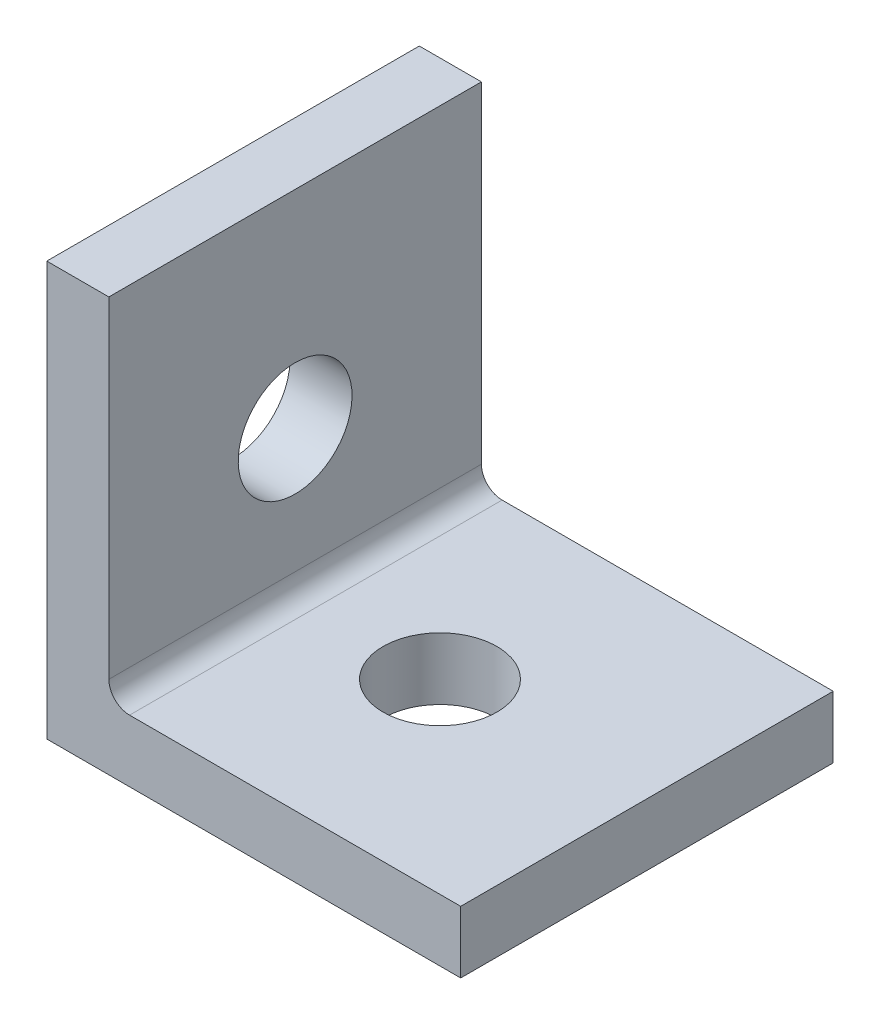
ISO-10303-21;
HEADER;
FILE_DESCRIPTION(('STEP AP214'),'2;1');
FILE_NAME('part.step','',(''),(''),'','','');
FILE_SCHEMA(('AUTOMOTIVE_DESIGN { 1 0 10303 214 1 1 1 1 }'));
ENDSEC;
DATA;
#1=APPLICATION_CONTEXT('core data for automotive mechanical design processes');
#2=APPLICATION_PROTOCOL_DEFINITION('international standard','automotive_design',2000,#1);
#3=PRODUCT_CONTEXT('',#1,'mechanical');
#4=PRODUCT('Part','Part','',(#3));
#5=PRODUCT_RELATED_PRODUCT_CATEGORY('part','',(#4));
#6=PRODUCT_DEFINITION_FORMATION('','',#4);
#7=PRODUCT_DEFINITION_CONTEXT('part definition',#1,'design');
#8=PRODUCT_DEFINITION('design','',#6,#7);
#9=PRODUCT_DEFINITION_SHAPE('','',#8);
#10=(LENGTH_UNIT() NAMED_UNIT(*) SI_UNIT(.MILLI.,.METRE.));
#11=(NAMED_UNIT(*) PLANE_ANGLE_UNIT() SI_UNIT($,.RADIAN.));
#12=(NAMED_UNIT(*) SI_UNIT($,.STERADIAN.) SOLID_ANGLE_UNIT());
#13=UNCERTAINTY_MEASURE_WITH_UNIT(LENGTH_MEASURE(1.E-05),#10,'distance_accuracy_value','');
#14=(GEOMETRIC_REPRESENTATION_CONTEXT(3) GLOBAL_UNCERTAINTY_ASSIGNED_CONTEXT((#13)) GLOBAL_UNIT_ASSIGNED_CONTEXT((#10,
#11,#12)) REPRESENTATION_CONTEXT('',''));
#15=CARTESIAN_POINT('',(0.,0.,0.));
#16=DIRECTION('',(0.,0.,1.));
#17=DIRECTION('',(1.,0.,0.));
#18=AXIS2_PLACEMENT_3D('',#15,#16,#17);
#19=CARTESIAN_POINT('',(20.,0.,9.));
#20=DIRECTION('',(0.,1.,0.));
#21=DIRECTION('',(-1.,0.,0.));
#22=AXIS2_PLACEMENT_3D('',#19,#20,#21);
#23=PLANE('',#22);
#24=CARTESIAN_POINT('',(10.,0.,0.));
#25=DIRECTION('',(0.,1.,0.));
#26=DIRECTION('',(0.,0.,1.));
#27=AXIS2_PLACEMENT_3D('',#24,#25,#26);
#28=CIRCLE('',#27,2.75);
#29=CARTESIAN_POINT('',(10.,0.,2.75));
#30=VERTEX_POINT('',#29);
#31=EDGE_CURVE('E126',#30,#30,#28,.T.);
#32=ORIENTED_EDGE('',*,*,#31,.T.);
#33=EDGE_LOOP('',(#32));
#34=FACE_BOUND('',#33,.T.);
#35=DIRECTION('',(1.,0.,0.));
#36=VECTOR('',#35,1.);
#37=CARTESIAN_POINT('',(20.,0.,-9.));
#38=LINE('',#37,#36);
#39=CARTESIAN_POINT('',(0.,0.,-9.));
#40=VERTEX_POINT('',#39);
#41=CARTESIAN_POINT('',(20.,0.,-9.));
#42=VERTEX_POINT('',#41);
#43=EDGE_CURVE('E122',#40,#42,#38,.T.);
#44=ORIENTED_EDGE('',*,*,#43,.T.);
#45=DIRECTION('',(0.,0.,-1.));
#46=VECTOR('',#45,1.);
#47=CARTESIAN_POINT('',(20.,0.,9.));
#48=LINE('',#47,#46);
#49=CARTESIAN_POINT('',(20.,0.,9.));
#50=VERTEX_POINT('',#49);
#51=EDGE_CURVE('E11',#50,#42,#48,.T.);
#52=ORIENTED_EDGE('',*,*,#51,.F.);
#53=DIRECTION('',(1.,0.,0.));
#54=VECTOR('',#53,1.);
#55=CARTESIAN_POINT('',(20.,0.,9.));
#56=LINE('',#55,#54);
#57=CARTESIAN_POINT('',(0.,0.,9.));
#58=VERTEX_POINT('',#57);
#59=EDGE_CURVE('E135',#58,#50,#56,.T.);
#60=ORIENTED_EDGE('',*,*,#59,.F.);
#61=DIRECTION('',(0.,0.,-1.));
#62=VECTOR('',#61,1.);
#63=CARTESIAN_POINT('',(0.,0.,9.));
#64=LINE('',#63,#62);
#65=EDGE_CURVE('E118',#58,#40,#64,.T.);
#66=ORIENTED_EDGE('',*,*,#65,.T.);
#67=EDGE_LOOP('',(#44,#52,#60,#66));
#68=FACE_BOUND('',#67,.T.);
#69=ADVANCED_FACE('F32',(#34,#68),#23,.F.);
#70=CARTESIAN_POINT('',(20.,3.,9.));
#71=DIRECTION('',(-1.,0.,0.));
#72=DIRECTION('',(0.,0.,1.));
#73=AXIS2_PLACEMENT_3D('',#70,#71,#72);
#74=PLANE('',#73);
#75=DIRECTION('',(0.,1.,0.));
#76=VECTOR('',#75,1.);
#77=CARTESIAN_POINT('',(20.,3.,-9.));
#78=LINE('',#77,#76);
#79=CARTESIAN_POINT('',(20.,3.,-9.));
#80=VERTEX_POINT('',#79);
#81=EDGE_CURVE('E125',#42,#80,#78,.T.);
#82=ORIENTED_EDGE('',*,*,#81,.T.);
#83=DIRECTION('',(0.,0.,-1.));
#84=VECTOR('',#83,1.);
#85=CARTESIAN_POINT('',(20.,3.,9.));
#86=LINE('',#85,#84);
#87=CARTESIAN_POINT('',(20.,3.,9.));
#88=VERTEX_POINT('',#87);
#89=EDGE_CURVE('E40',#88,#80,#86,.T.);
#90=ORIENTED_EDGE('',*,*,#89,.F.);
#91=DIRECTION('',(0.,1.,0.));
#92=VECTOR('',#91,1.);
#93=CARTESIAN_POINT('',(20.,3.,9.));
#94=LINE('',#93,#92);
#95=EDGE_CURVE('E88',#50,#88,#94,.T.);
#96=ORIENTED_EDGE('',*,*,#95,.F.);
#97=ORIENTED_EDGE('',*,*,#51,.T.);
#98=EDGE_LOOP('',(#82,#90,#96,#97));
#99=FACE_BOUND('',#98,.T.);
#100=ADVANCED_FACE('F188',(#99),#74,.F.);
#101=CARTESIAN_POINT('',(4.,3.,9.));
#102=DIRECTION('',(0.,-1.,0.));
#103=DIRECTION('',(0.,0.,-1.));
#104=AXIS2_PLACEMENT_3D('',#101,#102,#103);
#105=PLANE('',#104);
#106=CARTESIAN_POINT('',(10.,3.,0.));
#107=DIRECTION('',(0.,1.,0.));
#108=DIRECTION('',(0.,0.,1.));
#109=AXIS2_PLACEMENT_3D('',#106,#107,#108);
#110=CIRCLE('',#109,2.75);
#111=CARTESIAN_POINT('',(10.,3.,2.75));
#112=VERTEX_POINT('',#111);
#113=EDGE_CURVE('E158',#112,#112,#110,.T.);
#114=ORIENTED_EDGE('',*,*,#113,.F.);
#115=EDGE_LOOP('',(#114));
#116=FACE_BOUND('',#115,.T.);
#117=DIRECTION('',(-1.,0.,0.));
#118=VECTOR('',#117,1.);
#119=CARTESIAN_POINT('',(4.,3.,-9.));
#120=LINE('',#119,#118);
#121=CARTESIAN_POINT('',(4.,3.,-9.));
#122=VERTEX_POINT('',#121);
#123=EDGE_CURVE('E128',#80,#122,#120,.T.);
#124=ORIENTED_EDGE('',*,*,#123,.T.);
#125=DIRECTION('',(0.,0.,-1.));
#126=VECTOR('',#125,1.);
#127=CARTESIAN_POINT('',(4.,3.,9.));
#128=LINE('',#127,#126);
#129=CARTESIAN_POINT('',(4.,3.,9.));
#130=VERTEX_POINT('',#129);
#131=EDGE_CURVE('E139',#130,#122,#128,.T.);
#132=ORIENTED_EDGE('',*,*,#131,.F.);
#133=DIRECTION('',(-1.,0.,0.));
#134=VECTOR('',#133,1.);
#135=CARTESIAN_POINT('',(4.,3.,9.));
#136=LINE('',#135,#134);
#137=EDGE_CURVE('E147',#88,#130,#136,.T.);
#138=ORIENTED_EDGE('',*,*,#137,.F.);
#139=ORIENTED_EDGE('',*,*,#89,.T.);
#140=EDGE_LOOP('',(#124,#132,#138,#139));
#141=FACE_BOUND('',#140,.T.);
#142=ADVANCED_FACE('F145',(#116,#141),#105,.F.);
#143=CARTESIAN_POINT('',(4.,4.,9.));
#144=DIRECTION('',(0.,0.,-1.));
#145=DIRECTION('',(-1.,0.,0.));
#146=AXIS2_PLACEMENT_3D('',#143,#144,#145);
#147=CYLINDRICAL_SURFACE('',#146,1.);
#148=CARTESIAN_POINT('',(4.,4.,-9.));
#149=DIRECTION('',(0.,0.,-1.));
#150=DIRECTION('',(-1.,0.,0.));
#151=AXIS2_PLACEMENT_3D('',#148,#149,#150);
#152=CIRCLE('',#151,1.);
#153=CARTESIAN_POINT('',(3.,4.,-9.));
#154=VERTEX_POINT('',#153);
#155=EDGE_CURVE('E130',#122,#154,#152,.T.);
#156=ORIENTED_EDGE('',*,*,#155,.T.);
#157=DIRECTION('',(0.,0.,-1.));
#158=VECTOR('',#157,1.);
#159=CARTESIAN_POINT('',(3.,4.,9.));
#160=LINE('',#159,#158);
#161=CARTESIAN_POINT('',(3.,4.,9.));
#162=VERTEX_POINT('',#161);
#163=EDGE_CURVE('E113',#162,#154,#160,.T.);
#164=ORIENTED_EDGE('',*,*,#163,.F.);
#165=CARTESIAN_POINT('',(4.,4.,9.));
#166=DIRECTION('',(0.,0.,-1.));
#167=DIRECTION('',(-1.,0.,0.));
#168=AXIS2_PLACEMENT_3D('',#165,#166,#167);
#169=CIRCLE('',#168,1.);
#170=EDGE_CURVE('E104',#130,#162,#169,.T.);
#171=ORIENTED_EDGE('',*,*,#170,.F.);
#172=ORIENTED_EDGE('',*,*,#131,.T.);
#173=EDGE_LOOP('',(#156,#164,#171,#172));
#174=FACE_BOUND('',#173,.T.);
#175=ADVANCED_FACE('F153',(#174),#147,.F.);
#176=CARTESIAN_POINT('',(3.,20.,9.));
#177=DIRECTION('',(-1.,0.,0.));
#178=DIRECTION('',(0.,-1.,0.));
#179=AXIS2_PLACEMENT_3D('',#176,#177,#178);
#180=PLANE('',#179);
#181=CARTESIAN_POINT('',(3.,9.99999999999999,0.));
#182=DIRECTION('',(1.,0.,0.));
#183=DIRECTION('',(0.,1.,0.));
#184=AXIS2_PLACEMENT_3D('',#181,#182,#183);
#185=CIRCLE('',#184,2.75);
#186=CARTESIAN_POINT('',(3.,12.75,0.));
#187=VERTEX_POINT('',#186);
#188=EDGE_CURVE('E164',#187,#187,#185,.T.);
#189=ORIENTED_EDGE('',*,*,#188,.F.);
#190=EDGE_LOOP('',(#189));
#191=FACE_BOUND('',#190,.T.);
#192=DIRECTION('',(0.,1.,0.));
#193=VECTOR('',#192,1.);
#194=CARTESIAN_POINT('',(3.,20.,-9.));
#195=LINE('',#194,#193);
#196=CARTESIAN_POINT('',(3.,20.,-9.));
#197=VERTEX_POINT('',#196);
#198=EDGE_CURVE('E112',#154,#197,#195,.T.);
#199=ORIENTED_EDGE('',*,*,#198,.T.);
#200=DIRECTION('',(0.,0.,-1.));
#201=VECTOR('',#200,1.);
#202=CARTESIAN_POINT('',(3.,20.,9.));
#203=LINE('',#202,#201);
#204=CARTESIAN_POINT('',(3.,20.,9.));
#205=VERTEX_POINT('',#204);
#206=EDGE_CURVE('E109',#205,#197,#203,.T.);
#207=ORIENTED_EDGE('',*,*,#206,.F.);
#208=DIRECTION('',(0.,1.,0.));
#209=VECTOR('',#208,1.);
#210=CARTESIAN_POINT('',(3.,20.,9.));
#211=LINE('',#210,#209);
#212=EDGE_CURVE('E98',#162,#205,#211,.T.);
#213=ORIENTED_EDGE('',*,*,#212,.F.);
#214=ORIENTED_EDGE('',*,*,#163,.T.);
#215=EDGE_LOOP('',(#199,#207,#213,#214));
#216=FACE_BOUND('',#215,.T.);
#217=ADVANCED_FACE('F110',(#191,#216),#180,.F.);
#218=CARTESIAN_POINT('',(0.,20.,9.));
#219=DIRECTION('',(0.,-1.,0.));
#220=DIRECTION('',(0.,0.,-1.));
#221=AXIS2_PLACEMENT_3D('',#218,#219,#220);
#222=PLANE('',#221);
#223=DIRECTION('',(-1.,0.,0.));
#224=VECTOR('',#223,1.);
#225=CARTESIAN_POINT('',(0.,20.,-9.));
#226=LINE('',#225,#224);
#227=CARTESIAN_POINT('',(0.,20.,-9.));
#228=VERTEX_POINT('',#227);
#229=EDGE_CURVE('E74',#197,#228,#226,.T.);
#230=ORIENTED_EDGE('',*,*,#229,.T.);
#231=DIRECTION('',(0.,0.,-1.));
#232=VECTOR('',#231,1.);
#233=CARTESIAN_POINT('',(0.,20.,9.));
#234=LINE('',#233,#232);
#235=CARTESIAN_POINT('',(0.,20.,9.));
#236=VERTEX_POINT('',#235);
#237=EDGE_CURVE('E114',#236,#228,#234,.T.);
#238=ORIENTED_EDGE('',*,*,#237,.F.);
#239=DIRECTION('',(-1.,0.,0.));
#240=VECTOR('',#239,1.);
#241=CARTESIAN_POINT('',(0.,20.,9.));
#242=LINE('',#241,#240);
#243=EDGE_CURVE('E102',#205,#236,#242,.T.);
#244=ORIENTED_EDGE('',*,*,#243,.F.);
#245=ORIENTED_EDGE('',*,*,#206,.T.);
#246=EDGE_LOOP('',(#230,#238,#244,#245));
#247=FACE_BOUND('',#246,.T.);
#248=ADVANCED_FACE('F116',(#247),#222,.F.);
#249=CARTESIAN_POINT('',(0.,0.,9.));
#250=DIRECTION('',(1.,0.,0.));
#251=DIRECTION('',(0.,0.,-1.));
#252=AXIS2_PLACEMENT_3D('',#249,#250,#251);
#253=PLANE('',#252);
#254=CARTESIAN_POINT('',(0.,9.99999999999999,0.));
#255=DIRECTION('',(1.,0.,0.));
#256=DIRECTION('',(0.,1.,0.));
#257=AXIS2_PLACEMENT_3D('',#254,#255,#256);
#258=CIRCLE('',#257,2.75);
#259=CARTESIAN_POINT('',(0.,12.75,0.));
#260=VERTEX_POINT('',#259);
#261=EDGE_CURVE('E161',#260,#260,#258,.T.);
#262=ORIENTED_EDGE('',*,*,#261,.T.);
#263=EDGE_LOOP('',(#262));
#264=FACE_BOUND('',#263,.T.);
#265=DIRECTION('',(0.,-1.,0.));
#266=VECTOR('',#265,1.);
#267=CARTESIAN_POINT('',(0.,0.,-9.));
#268=LINE('',#267,#266);
#269=EDGE_CURVE('E80',#228,#40,#268,.T.);
#270=ORIENTED_EDGE('',*,*,#269,.T.);
#271=ORIENTED_EDGE('',*,*,#65,.F.);
#272=DIRECTION('',(0.,-1.,0.));
#273=VECTOR('',#272,1.);
#274=CARTESIAN_POINT('',(0.,0.,9.));
#275=LINE('',#274,#273);
#276=EDGE_CURVE('E48',#236,#58,#275,.T.);
#277=ORIENTED_EDGE('',*,*,#276,.F.);
#278=ORIENTED_EDGE('',*,*,#237,.T.);
#279=EDGE_LOOP('',(#270,#271,#277,#278));
#280=FACE_BOUND('',#279,.T.);
#281=ADVANCED_FACE('F170',(#264,#280),#253,.F.);
#282=CARTESIAN_POINT('',(4.,4.,9.));
#283=DIRECTION('',(0.,0.,-1.));
#284=DIRECTION('',(-1.,0.,0.));
#285=AXIS2_PLACEMENT_3D('',#282,#283,#284);
#286=PLANE('',#285);
#287=ORIENTED_EDGE('',*,*,#59,.T.);
#288=ORIENTED_EDGE('',*,*,#95,.T.);
#289=ORIENTED_EDGE('',*,*,#137,.T.);
#290=ORIENTED_EDGE('',*,*,#170,.T.);
#291=ORIENTED_EDGE('',*,*,#212,.T.);
#292=ORIENTED_EDGE('',*,*,#243,.T.);
#293=ORIENTED_EDGE('',*,*,#276,.T.);
#294=EDGE_LOOP('',(#287,#288,#289,#290,#291,#292,#293));
#295=FACE_BOUND('',#294,.T.);
#296=ADVANCED_FACE('F100',(#295),#286,.F.);
#297=CARTESIAN_POINT('',(4.,4.,-9.));
#298=DIRECTION('',(0.,0.,-1.));
#299=DIRECTION('',(-1.,0.,0.));
#300=AXIS2_PLACEMENT_3D('',#297,#298,#299);
#301=PLANE('',#300);
#302=ORIENTED_EDGE('',*,*,#43,.F.);
#303=ORIENTED_EDGE('',*,*,#269,.F.);
#304=ORIENTED_EDGE('',*,*,#229,.F.);
#305=ORIENTED_EDGE('',*,*,#198,.F.);
#306=ORIENTED_EDGE('',*,*,#155,.F.);
#307=ORIENTED_EDGE('',*,*,#123,.F.);
#308=ORIENTED_EDGE('',*,*,#81,.F.);
#309=EDGE_LOOP('',(#302,#303,#304,#305,#306,#307,#308));
#310=FACE_BOUND('',#309,.T.);
#311=ADVANCED_FACE('F151',(#310),#301,.T.);
#312=CARTESIAN_POINT('',(10.,0.,0.));
#313=DIRECTION('',(0.,1.,0.));
#314=DIRECTION('',(0.,0.,1.));
#315=AXIS2_PLACEMENT_3D('',#312,#313,#314);
#316=CYLINDRICAL_SURFACE('',#315,2.75);
#317=ORIENTED_EDGE('',*,*,#31,.F.);
#318=EDGE_LOOP('',(#317));
#319=FACE_BOUND('',#318,.T.);
#320=ORIENTED_EDGE('',*,*,#113,.T.);
#321=EDGE_LOOP('',(#320));
#322=FACE_BOUND('',#321,.T.);
#323=ADVANCED_FACE('F175',(#319,#322),#316,.F.);
#324=CARTESIAN_POINT('',(0.,9.99999999999999,0.));
#325=DIRECTION('',(1.,0.,0.));
#326=DIRECTION('',(0.,1.,0.));
#327=AXIS2_PLACEMENT_3D('',#324,#325,#326);
#328=CYLINDRICAL_SURFACE('',#327,2.75);
#329=ORIENTED_EDGE('',*,*,#261,.F.);
#330=EDGE_LOOP('',(#329));
#331=FACE_BOUND('',#330,.T.);
#332=ORIENTED_EDGE('',*,*,#188,.T.);
#333=EDGE_LOOP('',(#332));
#334=FACE_BOUND('',#333,.T.);
#335=ADVANCED_FACE('F172',(#331,#334),#328,.F.);
#336=CLOSED_SHELL('',(#69,#100,#142,#175,#217,#248,#281,#296,#311,#323,#335));
#337=MANIFOLD_SOLID_BREP('B2',#336);
#338=ADVANCED_BREP_SHAPE_REPRESENTATION('',(#18,#337),#14);
#339=SHAPE_DEFINITION_REPRESENTATION(#9,#338);
ENDSEC;
END-ISO-10303-21;
